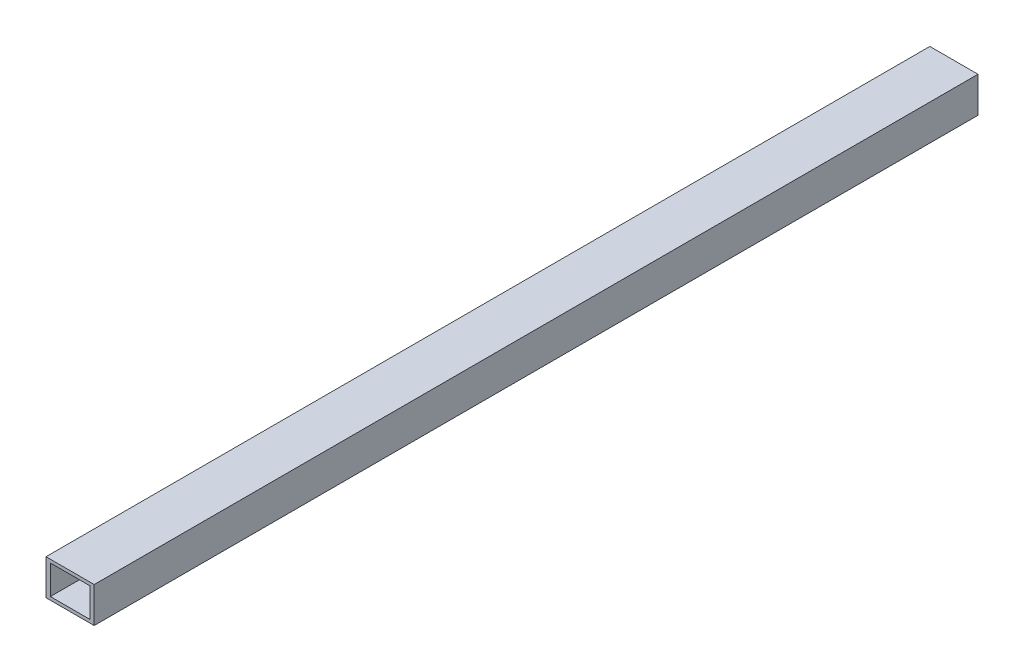
ISO-10303-21;
HEADER;
FILE_DESCRIPTION(('STEP AP214'),'2;1');
FILE_NAME('part.step','',(''),(''),'','','');
FILE_SCHEMA(('AUTOMOTIVE_DESIGN { 1 0 10303 214 1 1 1 1 }'));
ENDSEC;
DATA;
#1=APPLICATION_CONTEXT('core data for automotive mechanical design processes');
#2=APPLICATION_PROTOCOL_DEFINITION('international standard','automotive_design',2000,#1);
#3=PRODUCT_CONTEXT('',#1,'mechanical');
#4=PRODUCT('Part','Part','',(#3));
#5=PRODUCT_RELATED_PRODUCT_CATEGORY('part','',(#4));
#6=PRODUCT_DEFINITION_FORMATION('','',#4);
#7=PRODUCT_DEFINITION_CONTEXT('part definition',#1,'design');
#8=PRODUCT_DEFINITION('design','',#6,#7);
#9=PRODUCT_DEFINITION_SHAPE('','',#8);
#10=(LENGTH_UNIT() NAMED_UNIT(*) SI_UNIT(.MILLI.,.METRE.));
#11=(NAMED_UNIT(*) PLANE_ANGLE_UNIT() SI_UNIT($,.RADIAN.));
#12=(NAMED_UNIT(*) SI_UNIT($,.STERADIAN.) SOLID_ANGLE_UNIT());
#13=UNCERTAINTY_MEASURE_WITH_UNIT(LENGTH_MEASURE(1.E-05),#10,'distance_accuracy_value','');
#14=(GEOMETRIC_REPRESENTATION_CONTEXT(3) GLOBAL_UNCERTAINTY_ASSIGNED_CONTEXT((#13)) GLOBAL_UNIT_ASSIGNED_CONTEXT((#10,
#11,#12)) REPRESENTATION_CONTEXT('',''));
#15=CARTESIAN_POINT('',(0.,0.,0.));
#16=DIRECTION('',(0.,0.,1.));
#17=DIRECTION('',(1.,0.,0.));
#18=AXIS2_PLACEMENT_3D('',#15,#16,#17);
#19=CARTESIAN_POINT('',(0.,0.,500.));
#20=DIRECTION('',(0.,0.,-1.));
#21=DIRECTION('',(-1.,0.,0.));
#22=AXIS2_PLACEMENT_3D('',#19,#20,#21);
#23=PLANE('',#22);
#24=DIRECTION('',(0.,1.,0.));
#25=VECTOR('',#24,1.);
#26=CARTESIAN_POINT('',(27.2484173051621,-20.1157433635167,500.));
#27=LINE('',#26,#25);
#28=CARTESIAN_POINT('',(27.2484173051621,-20.1157433635167,500.));
#29=VERTEX_POINT('',#28);
#30=CARTESIAN_POINT('',(27.2484173051621,20.1157433635167,500.));
#31=VERTEX_POINT('',#30);
#32=EDGE_CURVE('E134',#29,#31,#27,.T.);
#33=ORIENTED_EDGE('',*,*,#32,.T.);
#34=DIRECTION('',(-1.,0.,0.));
#35=VECTOR('',#34,1.);
#36=CARTESIAN_POINT('',(-27.2484173051621,20.1157433635167,500.));
#37=LINE('',#36,#35);
#38=CARTESIAN_POINT('',(-27.2484173051621,20.1157433635167,500.));
#39=VERTEX_POINT('',#38);
#40=EDGE_CURVE('E137',#31,#39,#37,.T.);
#41=ORIENTED_EDGE('',*,*,#40,.T.);
#42=DIRECTION('',(0.,-1.,0.));
#43=VECTOR('',#42,1.);
#44=CARTESIAN_POINT('',(-27.2484173051621,-20.1157433635167,500.));
#45=LINE('',#44,#43);
#46=CARTESIAN_POINT('',(-27.2484173051621,-20.1157433635167,500.));
#47=VERTEX_POINT('',#46);
#48=EDGE_CURVE('E140',#39,#47,#45,.T.);
#49=ORIENTED_EDGE('',*,*,#48,.T.);
#50=DIRECTION('',(1.,0.,0.));
#51=VECTOR('',#50,1.);
#52=CARTESIAN_POINT('',(-27.2484173051621,-20.1157433635167,500.));
#53=LINE('',#52,#51);
#54=EDGE_CURVE('E142',#47,#29,#53,.T.);
#55=ORIENTED_EDGE('',*,*,#54,.T.);
#56=EDGE_LOOP('',(#33,#41,#49,#55));
#57=FACE_BOUND('',#56,.T.);
#58=DIRECTION('',(0.,1.,0.));
#59=VECTOR('',#58,1.);
#60=CARTESIAN_POINT('',(22.2979598904897,-16.4611409779792,500.));
#61=LINE('',#60,#59);
#62=CARTESIAN_POINT('',(22.2979598904897,-16.4611409779792,500.));
#63=VERTEX_POINT('',#62);
#64=CARTESIAN_POINT('',(22.2979598904897,16.4611409779792,500.));
#65=VERTEX_POINT('',#64);
#66=EDGE_CURVE('E98',#63,#65,#61,.T.);
#67=ORIENTED_EDGE('',*,*,#66,.F.);
#68=DIRECTION('',(1.,0.,0.));
#69=VECTOR('',#68,1.);
#70=CARTESIAN_POINT('',(-22.2979598904897,-16.4611409779792,500.));
#71=LINE('',#70,#69);
#72=CARTESIAN_POINT('',(-22.2979598904897,-16.4611409779792,500.));
#73=VERTEX_POINT('',#72);
#74=EDGE_CURVE('E120',#73,#63,#71,.T.);
#75=ORIENTED_EDGE('',*,*,#74,.F.);
#76=DIRECTION('',(0.,-1.,0.));
#77=VECTOR('',#76,1.);
#78=CARTESIAN_POINT('',(-22.2979598904897,-16.4611409779792,500.));
#79=LINE('',#78,#77);
#80=CARTESIAN_POINT('',(-22.2979598904897,16.4611409779792,500.));
#81=VERTEX_POINT('',#80);
#82=EDGE_CURVE('E118',#81,#73,#79,.T.);
#83=ORIENTED_EDGE('',*,*,#82,.F.);
#84=DIRECTION('',(-1.,0.,0.));
#85=VECTOR('',#84,1.);
#86=CARTESIAN_POINT('',(-22.2979598904897,16.4611409779792,500.));
#87=LINE('',#86,#85);
#88=EDGE_CURVE('E106',#65,#81,#87,.T.);
#89=ORIENTED_EDGE('',*,*,#88,.F.);
#90=EDGE_LOOP('',(#67,#75,#83,#89));
#91=FACE_BOUND('',#90,.T.);
#92=ADVANCED_FACE('F33',(#57,#91),#23,.F.);
#93=CARTESIAN_POINT('',(0.,0.,-500.));
#94=DIRECTION('',(0.,0.,-1.));
#95=DIRECTION('',(-1.,0.,0.));
#96=AXIS2_PLACEMENT_3D('',#93,#94,#95);
#97=PLANE('',#96);
#98=DIRECTION('',(0.,1.,0.));
#99=VECTOR('',#98,1.);
#100=CARTESIAN_POINT('',(27.2484173051621,-20.1157433635167,-500.));
#101=LINE('',#100,#99);
#102=CARTESIAN_POINT('',(27.2484173051621,-20.1157433635167,-500.));
#103=VERTEX_POINT('',#102);
#104=CARTESIAN_POINT('',(27.2484173051621,20.1157433635167,-500.));
#105=VERTEX_POINT('',#104);
#106=EDGE_CURVE('E114',#103,#105,#101,.T.);
#107=ORIENTED_EDGE('',*,*,#106,.F.);
#108=DIRECTION('',(1.,0.,0.));
#109=VECTOR('',#108,1.);
#110=CARTESIAN_POINT('',(-27.2484173051621,-20.1157433635167,-500.));
#111=LINE('',#110,#109);
#112=CARTESIAN_POINT('',(-27.2484173051621,-20.1157433635167,-500.));
#113=VERTEX_POINT('',#112);
#114=EDGE_CURVE('E138',#113,#103,#111,.T.);
#115=ORIENTED_EDGE('',*,*,#114,.F.);
#116=DIRECTION('',(0.,-1.,0.));
#117=VECTOR('',#116,1.);
#118=CARTESIAN_POINT('',(-27.2484173051621,-20.1157433635167,-500.));
#119=LINE('',#118,#117);
#120=CARTESIAN_POINT('',(-27.2484173051621,20.1157433635167,-500.));
#121=VERTEX_POINT('',#120);
#122=EDGE_CURVE('E149',#121,#113,#119,.T.);
#123=ORIENTED_EDGE('',*,*,#122,.F.);
#124=DIRECTION('',(-1.,0.,0.));
#125=VECTOR('',#124,1.);
#126=CARTESIAN_POINT('',(-27.2484173051621,20.1157433635167,-500.));
#127=LINE('',#126,#125);
#128=EDGE_CURVE('E147',#105,#121,#127,.T.);
#129=ORIENTED_EDGE('',*,*,#128,.F.);
#130=EDGE_LOOP('',(#107,#115,#123,#129));
#131=FACE_BOUND('',#130,.T.);
#132=DIRECTION('',(1.,0.,0.));
#133=VECTOR('',#132,1.);
#134=CARTESIAN_POINT('',(-22.2979598904897,-16.4611409779792,-500.));
#135=LINE('',#134,#133);
#136=CARTESIAN_POINT('',(-22.2979598904897,-16.4611409779792,-500.));
#137=VERTEX_POINT('',#136);
#138=CARTESIAN_POINT('',(22.2979598904897,-16.4611409779792,-500.));
#139=VERTEX_POINT('',#138);
#140=EDGE_CURVE('E107',#137,#139,#135,.T.);
#141=ORIENTED_EDGE('',*,*,#140,.T.);
#142=DIRECTION('',(0.,1.,0.));
#143=VECTOR('',#142,1.);
#144=CARTESIAN_POINT('',(22.2979598904897,-16.4611409779792,-500.));
#145=LINE('',#144,#143);
#146=CARTESIAN_POINT('',(22.2979598904897,16.4611409779792,-500.));
#147=VERTEX_POINT('',#146);
#148=EDGE_CURVE('E56',#139,#147,#145,.T.);
#149=ORIENTED_EDGE('',*,*,#148,.T.);
#150=DIRECTION('',(-1.,0.,0.));
#151=VECTOR('',#150,1.);
#152=CARTESIAN_POINT('',(-22.2979598904897,16.4611409779792,-500.));
#153=LINE('',#152,#151);
#154=CARTESIAN_POINT('',(-22.2979598904897,16.4611409779792,-500.));
#155=VERTEX_POINT('',#154);
#156=EDGE_CURVE('E113',#147,#155,#153,.T.);
#157=ORIENTED_EDGE('',*,*,#156,.T.);
#158=DIRECTION('',(0.,-1.,0.));
#159=VECTOR('',#158,1.);
#160=CARTESIAN_POINT('',(-22.2979598904897,-16.4611409779792,-500.));
#161=LINE('',#160,#159);
#162=EDGE_CURVE('E126',#155,#137,#161,.T.);
#163=ORIENTED_EDGE('',*,*,#162,.T.);
#164=EDGE_LOOP('',(#141,#149,#157,#163));
#165=FACE_BOUND('',#164,.T.);
#166=ADVANCED_FACE('F167',(#131,#165),#97,.T.);
#167=CARTESIAN_POINT('',(27.2484173051621,-20.1157433635167,500.));
#168=DIRECTION('',(-1.,0.,0.));
#169=DIRECTION('',(0.,0.,1.));
#170=AXIS2_PLACEMENT_3D('',#167,#168,#169);
#171=PLANE('',#170);
#172=ORIENTED_EDGE('',*,*,#106,.T.);
#173=DIRECTION('',(0.,0.,-1.));
#174=VECTOR('',#173,1.);
#175=CARTESIAN_POINT('',(27.2484173051621,20.1157433635167,500.));
#176=LINE('',#175,#174);
#177=EDGE_CURVE('E11',#31,#105,#176,.T.);
#178=ORIENTED_EDGE('',*,*,#177,.F.);
#179=ORIENTED_EDGE('',*,*,#32,.F.);
#180=DIRECTION('',(0.,0.,-1.));
#181=VECTOR('',#180,1.);
#182=CARTESIAN_POINT('',(27.2484173051621,-20.1157433635167,500.));
#183=LINE('',#182,#181);
#184=EDGE_CURVE('E144',#29,#103,#183,.T.);
#185=ORIENTED_EDGE('',*,*,#184,.T.);
#186=EDGE_LOOP('',(#172,#178,#179,#185));
#187=FACE_BOUND('',#186,.T.);
#188=ADVANCED_FACE('F35',(#187),#171,.F.);
#189=CARTESIAN_POINT('',(-27.2484173051621,20.1157433635167,500.));
#190=DIRECTION('',(0.,-1.,0.));
#191=DIRECTION('',(0.,0.,-1.));
#192=AXIS2_PLACEMENT_3D('',#189,#190,#191);
#193=PLANE('',#192);
#194=ORIENTED_EDGE('',*,*,#128,.T.);
#195=DIRECTION('',(0.,0.,-1.));
#196=VECTOR('',#195,1.);
#197=CARTESIAN_POINT('',(-27.2484173051621,20.1157433635167,500.));
#198=LINE('',#197,#196);
#199=EDGE_CURVE('E41',#39,#121,#198,.T.);
#200=ORIENTED_EDGE('',*,*,#199,.F.);
#201=ORIENTED_EDGE('',*,*,#40,.F.);
#202=ORIENTED_EDGE('',*,*,#177,.T.);
#203=EDGE_LOOP('',(#194,#200,#201,#202));
#204=FACE_BOUND('',#203,.T.);
#205=ADVANCED_FACE('F177',(#204),#193,.F.);
#206=CARTESIAN_POINT('',(-27.2484173051621,-20.1157433635167,500.));
#207=DIRECTION('',(1.,0.,0.));
#208=DIRECTION('',(0.,0.,-1.));
#209=AXIS2_PLACEMENT_3D('',#206,#207,#208);
#210=PLANE('',#209);
#211=ORIENTED_EDGE('',*,*,#122,.T.);
#212=DIRECTION('',(0.,0.,-1.));
#213=VECTOR('',#212,1.);
#214=CARTESIAN_POINT('',(-27.2484173051621,-20.1157433635167,500.));
#215=LINE('',#214,#213);
#216=EDGE_CURVE('E154',#47,#113,#215,.T.);
#217=ORIENTED_EDGE('',*,*,#216,.F.);
#218=ORIENTED_EDGE('',*,*,#48,.F.);
#219=ORIENTED_EDGE('',*,*,#199,.T.);
#220=EDGE_LOOP('',(#211,#217,#218,#219));
#221=FACE_BOUND('',#220,.T.);
#222=ADVANCED_FACE('F161',(#221),#210,.F.);
#223=CARTESIAN_POINT('',(-27.2484173051621,-20.1157433635167,500.));
#224=DIRECTION('',(0.,1.,0.));
#225=DIRECTION('',(0.,0.,1.));
#226=AXIS2_PLACEMENT_3D('',#223,#224,#225);
#227=PLANE('',#226);
#228=ORIENTED_EDGE('',*,*,#114,.T.);
#229=ORIENTED_EDGE('',*,*,#184,.F.);
#230=ORIENTED_EDGE('',*,*,#54,.F.);
#231=ORIENTED_EDGE('',*,*,#216,.T.);
#232=EDGE_LOOP('',(#228,#229,#230,#231));
#233=FACE_BOUND('',#232,.T.);
#234=ADVANCED_FACE('F171',(#233),#227,.F.);
#235=CARTESIAN_POINT('',(22.2979598904897,-16.4611409779792,500.));
#236=DIRECTION('',(-1.,0.,0.));
#237=DIRECTION('',(0.,0.,1.));
#238=AXIS2_PLACEMENT_3D('',#235,#236,#237);
#239=PLANE('',#238);
#240=ORIENTED_EDGE('',*,*,#148,.F.);
#241=DIRECTION('',(0.,0.,-1.));
#242=VECTOR('',#241,1.);
#243=CARTESIAN_POINT('',(22.2979598904897,-16.4611409779792,500.));
#244=LINE('',#243,#242);
#245=EDGE_CURVE('E102',#63,#139,#244,.T.);
#246=ORIENTED_EDGE('',*,*,#245,.F.);
#247=ORIENTED_EDGE('',*,*,#66,.T.);
#248=DIRECTION('',(0.,0.,-1.));
#249=VECTOR('',#248,1.);
#250=CARTESIAN_POINT('',(22.2979598904897,16.4611409779792,500.));
#251=LINE('',#250,#249);
#252=EDGE_CURVE('E101',#65,#147,#251,.T.);
#253=ORIENTED_EDGE('',*,*,#252,.T.);
#254=EDGE_LOOP('',(#240,#246,#247,#253));
#255=FACE_BOUND('',#254,.T.);
#256=ADVANCED_FACE('F100',(#255),#239,.T.);
#257=CARTESIAN_POINT('',(-22.2979598904897,16.4611409779792,500.));
#258=DIRECTION('',(0.,-1.,0.));
#259=DIRECTION('',(0.,0.,-1.));
#260=AXIS2_PLACEMENT_3D('',#257,#258,#259);
#261=PLANE('',#260);
#262=ORIENTED_EDGE('',*,*,#156,.F.);
#263=ORIENTED_EDGE('',*,*,#252,.F.);
#264=ORIENTED_EDGE('',*,*,#88,.T.);
#265=DIRECTION('',(0.,0.,-1.));
#266=VECTOR('',#265,1.);
#267=CARTESIAN_POINT('',(-22.2979598904897,16.4611409779792,500.));
#268=LINE('',#267,#266);
#269=EDGE_CURVE('E115',#81,#155,#268,.T.);
#270=ORIENTED_EDGE('',*,*,#269,.T.);
#271=EDGE_LOOP('',(#262,#263,#264,#270));
#272=FACE_BOUND('',#271,.T.);
#273=ADVANCED_FACE('F110',(#272),#261,.T.);
#274=CARTESIAN_POINT('',(-22.2979598904897,-16.4611409779792,500.));
#275=DIRECTION('',(1.,0.,0.));
#276=DIRECTION('',(0.,0.,-1.));
#277=AXIS2_PLACEMENT_3D('',#274,#275,#276);
#278=PLANE('',#277);
#279=ORIENTED_EDGE('',*,*,#162,.F.);
#280=ORIENTED_EDGE('',*,*,#269,.F.);
#281=ORIENTED_EDGE('',*,*,#82,.T.);
#282=DIRECTION('',(0.,0.,-1.));
#283=VECTOR('',#282,1.);
#284=CARTESIAN_POINT('',(-22.2979598904897,-16.4611409779792,500.));
#285=LINE('',#284,#283);
#286=EDGE_CURVE('E48',#73,#137,#285,.T.);
#287=ORIENTED_EDGE('',*,*,#286,.T.);
#288=EDGE_LOOP('',(#279,#280,#281,#287));
#289=FACE_BOUND('',#288,.T.);
#290=ADVANCED_FACE('F200',(#289),#278,.T.);
#291=CARTESIAN_POINT('',(-22.2979598904897,-16.4611409779792,500.));
#292=DIRECTION('',(0.,1.,0.));
#293=DIRECTION('',(0.,0.,1.));
#294=AXIS2_PLACEMENT_3D('',#291,#292,#293);
#295=PLANE('',#294);
#296=ORIENTED_EDGE('',*,*,#140,.F.);
#297=ORIENTED_EDGE('',*,*,#286,.F.);
#298=ORIENTED_EDGE('',*,*,#74,.T.);
#299=ORIENTED_EDGE('',*,*,#245,.T.);
#300=EDGE_LOOP('',(#296,#297,#298,#299));
#301=FACE_BOUND('',#300,.T.);
#302=ADVANCED_FACE('F204',(#301),#295,.T.);
#303=CLOSED_SHELL('',(#92,#166,#188,#205,#222,#234,#256,#273,#290,#302));
#304=MANIFOLD_SOLID_BREP('B2',#303);
#305=ADVANCED_BREP_SHAPE_REPRESENTATION('',(#18,#304),#14);
#306=SHAPE_DEFINITION_REPRESENTATION(#9,#305);
ENDSEC;
END-ISO-10303-21;
